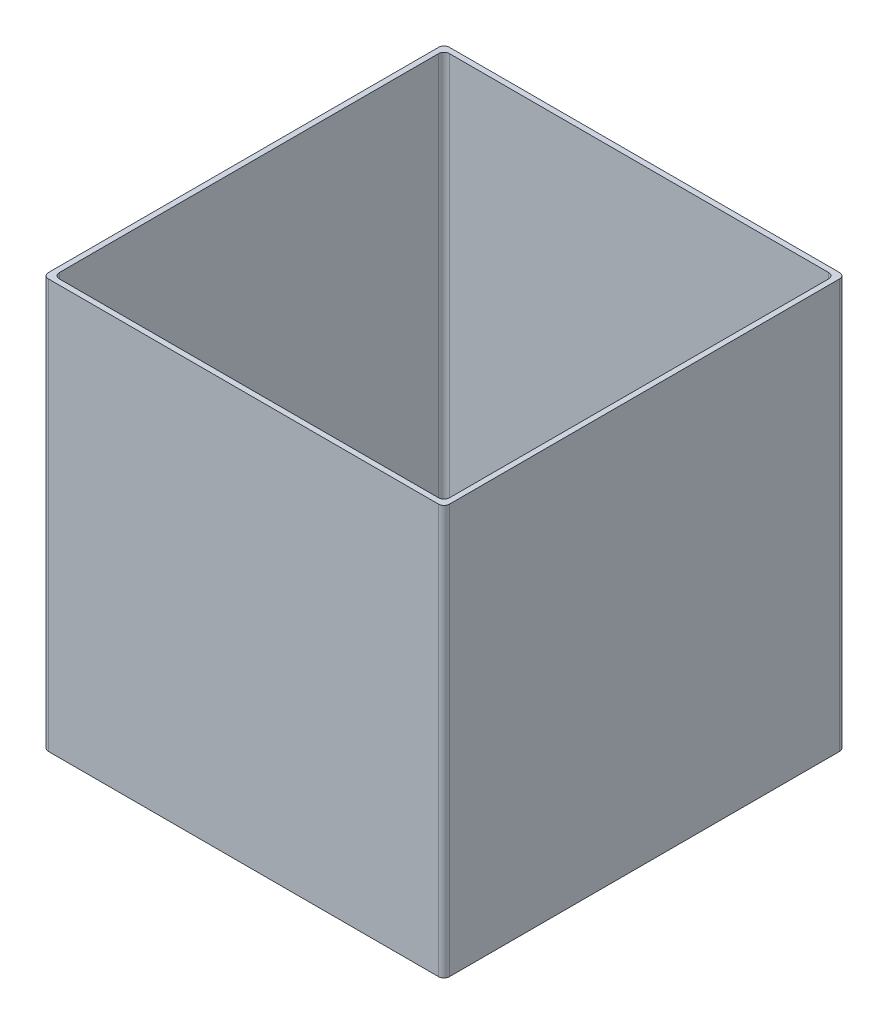
ISO-10303-21;
HEADER;
FILE_DESCRIPTION(('STEP AP214'),'2;1');
FILE_NAME('part.step','',(''),(''),'','','');
FILE_SCHEMA(('AUTOMOTIVE_DESIGN { 1 0 10303 214 1 1 1 1 }'));
ENDSEC;
DATA;
#1=APPLICATION_CONTEXT('core data for automotive mechanical design processes');
#2=APPLICATION_PROTOCOL_DEFINITION('international standard','automotive_design',2000,#1);
#3=PRODUCT_CONTEXT('',#1,'mechanical');
#4=PRODUCT('Part','Part','',(#3));
#5=PRODUCT_RELATED_PRODUCT_CATEGORY('part','',(#4));
#6=PRODUCT_DEFINITION_FORMATION('','',#4);
#7=PRODUCT_DEFINITION_CONTEXT('part definition',#1,'design');
#8=PRODUCT_DEFINITION('design','',#6,#7);
#9=PRODUCT_DEFINITION_SHAPE('','',#8);
#10=(LENGTH_UNIT() NAMED_UNIT(*) SI_UNIT(.MILLI.,.METRE.));
#11=(NAMED_UNIT(*) PLANE_ANGLE_UNIT() SI_UNIT($,.RADIAN.));
#12=(NAMED_UNIT(*) SI_UNIT($,.STERADIAN.) SOLID_ANGLE_UNIT());
#13=UNCERTAINTY_MEASURE_WITH_UNIT(LENGTH_MEASURE(1.E-05),#10,'distance_accuracy_value','');
#14=(GEOMETRIC_REPRESENTATION_CONTEXT(3) GLOBAL_UNCERTAINTY_ASSIGNED_CONTEXT((#13)) GLOBAL_UNIT_ASSIGNED_CONTEXT((#10,
#11,#12)) REPRESENTATION_CONTEXT('',''));
#15=CARTESIAN_POINT('',(0.,0.,0.));
#16=DIRECTION('',(0.,0.,1.));
#17=DIRECTION('',(1.,0.,0.));
#18=AXIS2_PLACEMENT_3D('',#15,#16,#17);
#19=CARTESIAN_POINT('',(2.,150.,-145.));
#20=DIRECTION('',(0.,-1.,0.));
#21=DIRECTION('',(0.,0.,-1.));
#22=AXIS2_PLACEMENT_3D('',#19,#20,#21);
#23=PLANE('',#22);
#24=CARTESIAN_POINT('',(2.,150.,-145.));
#25=DIRECTION('',(0.,1.,0.));
#26=DIRECTION('',(0.,0.,-1.));
#27=AXIS2_PLACEMENT_3D('',#24,#25,#26);
#28=CIRCLE('',#27,2.);
#29=CARTESIAN_POINT('',(2.00000000000001,150.,-147.));
#30=VERTEX_POINT('',#29);
#31=CARTESIAN_POINT('',(0.,150.,-145.));
#32=VERTEX_POINT('',#31);
#33=EDGE_CURVE('E215',#30,#32,#28,.T.);
#34=ORIENTED_EDGE('',*,*,#33,.T.);
#35=DIRECTION('',(0.,0.,1.));
#36=VECTOR('',#35,1.);
#37=CARTESIAN_POINT('',(0.,150.,-2.00000000000001));
#38=LINE('',#37,#36);
#39=CARTESIAN_POINT('',(0.,150.,-2.00000000000001));
#40=VERTEX_POINT('',#39);
#41=EDGE_CURVE('E218',#32,#40,#38,.T.);
#42=ORIENTED_EDGE('',*,*,#41,.T.);
#43=CARTESIAN_POINT('',(2.,150.,-2.));
#44=DIRECTION('',(0.,1.,0.));
#45=DIRECTION('',(0.,0.,-1.));
#46=AXIS2_PLACEMENT_3D('',#43,#44,#45);
#47=CIRCLE('',#46,2.);
#48=CARTESIAN_POINT('',(2.00000000000001,150.,0.));
#49=VERTEX_POINT('',#48);
#50=EDGE_CURVE('E221',#40,#49,#47,.T.);
#51=ORIENTED_EDGE('',*,*,#50,.T.);
#52=DIRECTION('',(1.,0.,0.));
#53=VECTOR('',#52,1.);
#54=CARTESIAN_POINT('',(2.00000000000001,150.,0.));
#55=LINE('',#54,#53);
#56=CARTESIAN_POINT('',(145.,150.,0.));
#57=VERTEX_POINT('',#56);
#58=EDGE_CURVE('E223',#49,#57,#55,.T.);
#59=ORIENTED_EDGE('',*,*,#58,.T.);
#60=CARTESIAN_POINT('',(145.,150.,-2.));
#61=DIRECTION('',(0.,1.,0.));
#62=DIRECTION('',(0.,0.,1.));
#63=AXIS2_PLACEMENT_3D('',#60,#61,#62);
#64=CIRCLE('',#63,2.);
#65=CARTESIAN_POINT('',(147.,150.,-2.00000000000001));
#66=VERTEX_POINT('',#65);
#67=EDGE_CURVE('E225',#57,#66,#64,.T.);
#68=ORIENTED_EDGE('',*,*,#67,.T.);
#69=DIRECTION('',(0.,0.,-1.));
#70=VECTOR('',#69,1.);
#71=CARTESIAN_POINT('',(147.,150.,-2.00000000000001));
#72=LINE('',#71,#70);
#73=CARTESIAN_POINT('',(147.,150.,-145.));
#74=VERTEX_POINT('',#73);
#75=EDGE_CURVE('E227',#66,#74,#72,.T.);
#76=ORIENTED_EDGE('',*,*,#75,.T.);
#77=CARTESIAN_POINT('',(145.,150.,-145.));
#78=DIRECTION('',(0.,1.,0.));
#79=DIRECTION('',(0.,0.,-1.));
#80=AXIS2_PLACEMENT_3D('',#77,#78,#79);
#81=CIRCLE('',#80,2.);
#82=CARTESIAN_POINT('',(145.,150.,-147.));
#83=VERTEX_POINT('',#82);
#84=EDGE_CURVE('E229',#74,#83,#81,.T.);
#85=ORIENTED_EDGE('',*,*,#84,.T.);
#86=DIRECTION('',(-1.,0.,0.));
#87=VECTOR('',#86,1.);
#88=CARTESIAN_POINT('',(2.00000000000001,150.,-147.));
#89=LINE('',#88,#87);
#90=EDGE_CURVE('E231',#83,#30,#89,.T.);
#91=ORIENTED_EDGE('',*,*,#90,.T.);
#92=EDGE_LOOP('',(#34,#42,#51,#59,#68,#76,#85,#91));
#93=FACE_BOUND('',#92,.T.);
#94=CARTESIAN_POINT('',(4.,150.,-143.));
#95=DIRECTION('',(0.,1.,0.));
#96=DIRECTION('',(0.,0.,1.));
#97=AXIS2_PLACEMENT_3D('',#94,#95,#96);
#98=CIRCLE('',#97,2.);
#99=CARTESIAN_POINT('',(4.00000000000001,150.,-145.));
#100=VERTEX_POINT('',#99);
#101=CARTESIAN_POINT('',(2.,150.,-143.));
#102=VERTEX_POINT('',#101);
#103=EDGE_CURVE('E150',#100,#102,#98,.T.);
#104=ORIENTED_EDGE('',*,*,#103,.F.);
#105=DIRECTION('',(-1.,0.,0.));
#106=VECTOR('',#105,1.);
#107=CARTESIAN_POINT('',(4.00000000000001,150.,-145.));
#108=LINE('',#107,#106);
#109=CARTESIAN_POINT('',(143.,150.,-145.));
#110=VERTEX_POINT('',#109);
#111=EDGE_CURVE('E183',#110,#100,#108,.T.);
#112=ORIENTED_EDGE('',*,*,#111,.F.);
#113=CARTESIAN_POINT('',(143.,150.,-143.));
#114=DIRECTION('',(0.,1.,0.));
#115=DIRECTION('',(0.,0.,-1.));
#116=AXIS2_PLACEMENT_3D('',#113,#114,#115);
#117=CIRCLE('',#116,2.);
#118=CARTESIAN_POINT('',(145.,150.,-143.));
#119=VERTEX_POINT('',#118);
#120=EDGE_CURVE('E181',#119,#110,#117,.T.);
#121=ORIENTED_EDGE('',*,*,#120,.F.);
#122=DIRECTION('',(0.,0.,-1.));
#123=VECTOR('',#122,1.);
#124=CARTESIAN_POINT('',(145.,150.,-143.));
#125=LINE('',#124,#123);
#126=CARTESIAN_POINT('',(145.,150.,-4.00000000000001));
#127=VERTEX_POINT('',#126);
#128=EDGE_CURVE('E179',#127,#119,#125,.T.);
#129=ORIENTED_EDGE('',*,*,#128,.F.);
#130=CARTESIAN_POINT('',(143.,150.,-4.));
#131=DIRECTION('',(0.,1.,0.));
#132=DIRECTION('',(0.,0.,1.));
#133=AXIS2_PLACEMENT_3D('',#130,#131,#132);
#134=CIRCLE('',#133,2.);
#135=CARTESIAN_POINT('',(143.,150.,-2.));
#136=VERTEX_POINT('',#135);
#137=EDGE_CURVE('E177',#136,#127,#134,.T.);
#138=ORIENTED_EDGE('',*,*,#137,.F.);
#139=DIRECTION('',(1.,0.,0.));
#140=VECTOR('',#139,1.);
#141=CARTESIAN_POINT('',(4.00000000000003,150.,-2.));
#142=LINE('',#141,#140);
#143=CARTESIAN_POINT('',(4.00000000000003,150.,-2.));
#144=VERTEX_POINT('',#143);
#145=EDGE_CURVE('E173',#144,#136,#142,.T.);
#146=ORIENTED_EDGE('',*,*,#145,.F.);
#147=CARTESIAN_POINT('',(4.00000000000002,150.,-4.));
#148=DIRECTION('',(0.,1.,0.));
#149=DIRECTION('',(0.,0.,1.));
#150=AXIS2_PLACEMENT_3D('',#147,#148,#149);
#151=CIRCLE('',#150,2.);
#152=CARTESIAN_POINT('',(2.00000000000002,150.,-4.00000000000002));
#153=VERTEX_POINT('',#152);
#154=EDGE_CURVE('E171',#153,#144,#151,.T.);
#155=ORIENTED_EDGE('',*,*,#154,.F.);
#156=DIRECTION('',(0.,0.,1.));
#157=VECTOR('',#156,1.);
#158=CARTESIAN_POINT('',(2.,150.,-143.));
#159=LINE('',#158,#157);
#160=EDGE_CURVE('E158',#102,#153,#159,.T.);
#161=ORIENTED_EDGE('',*,*,#160,.F.);
#162=EDGE_LOOP('',(#104,#112,#121,#129,#138,#146,#155,#161));
#163=FACE_BOUND('',#162,.T.);
#164=ADVANCED_FACE('F37',(#93,#163),#23,.F.);
#165=CARTESIAN_POINT('',(2.,0.,-145.));
#166=DIRECTION('',(0.,-1.,0.));
#167=DIRECTION('',(0.,0.,-1.));
#168=AXIS2_PLACEMENT_3D('',#165,#166,#167);
#169=PLANE('',#168);
#170=CARTESIAN_POINT('',(2.,0.,-145.));
#171=DIRECTION('',(0.,1.,0.));
#172=DIRECTION('',(0.,0.,-1.));
#173=AXIS2_PLACEMENT_3D('',#170,#171,#172);
#174=CIRCLE('',#173,2.);
#175=CARTESIAN_POINT('',(2.00000000000001,0.,-147.));
#176=VERTEX_POINT('',#175);
#177=CARTESIAN_POINT('',(0.,0.,-145.));
#178=VERTEX_POINT('',#177);
#179=EDGE_CURVE('E166',#176,#178,#174,.T.);
#180=ORIENTED_EDGE('',*,*,#179,.F.);
#181=DIRECTION('',(-1.,0.,0.));
#182=VECTOR('',#181,1.);
#183=CARTESIAN_POINT('',(2.00000000000001,0.,-147.));
#184=LINE('',#183,#182);
#185=CARTESIAN_POINT('',(145.,0.,-147.));
#186=VERTEX_POINT('',#185);
#187=EDGE_CURVE('E219',#186,#176,#184,.T.);
#188=ORIENTED_EDGE('',*,*,#187,.F.);
#189=CARTESIAN_POINT('',(145.,0.,-145.));
#190=DIRECTION('',(0.,1.,0.));
#191=DIRECTION('',(0.,0.,-1.));
#192=AXIS2_PLACEMENT_3D('',#189,#190,#191);
#193=CIRCLE('',#192,2.);
#194=CARTESIAN_POINT('',(147.,0.,-145.));
#195=VERTEX_POINT('',#194);
#196=EDGE_CURVE('E246',#195,#186,#193,.T.);
#197=ORIENTED_EDGE('',*,*,#196,.F.);
#198=DIRECTION('',(0.,0.,-1.));
#199=VECTOR('',#198,1.);
#200=CARTESIAN_POINT('',(147.,0.,-2.00000000000001));
#201=LINE('',#200,#199);
#202=CARTESIAN_POINT('',(147.,0.,-2.00000000000001));
#203=VERTEX_POINT('',#202);
#204=EDGE_CURVE('E244',#203,#195,#201,.T.);
#205=ORIENTED_EDGE('',*,*,#204,.F.);
#206=CARTESIAN_POINT('',(145.,0.,-2.));
#207=DIRECTION('',(0.,1.,0.));
#208=DIRECTION('',(0.,0.,1.));
#209=AXIS2_PLACEMENT_3D('',#206,#207,#208);
#210=CIRCLE('',#209,2.);
#211=CARTESIAN_POINT('',(145.,0.,0.));
#212=VERTEX_POINT('',#211);
#213=EDGE_CURVE('E242',#212,#203,#210,.T.);
#214=ORIENTED_EDGE('',*,*,#213,.F.);
#215=DIRECTION('',(1.,0.,0.));
#216=VECTOR('',#215,1.);
#217=CARTESIAN_POINT('',(2.00000000000001,0.,0.));
#218=LINE('',#217,#216);
#219=CARTESIAN_POINT('',(2.00000000000001,0.,0.));
#220=VERTEX_POINT('',#219);
#221=EDGE_CURVE('E240',#220,#212,#218,.T.);
#222=ORIENTED_EDGE('',*,*,#221,.F.);
#223=CARTESIAN_POINT('',(2.,0.,-2.));
#224=DIRECTION('',(0.,1.,0.));
#225=DIRECTION('',(0.,0.,-1.));
#226=AXIS2_PLACEMENT_3D('',#223,#224,#225);
#227=CIRCLE('',#226,2.);
#228=CARTESIAN_POINT('',(0.,0.,-2.00000000000001));
#229=VERTEX_POINT('',#228);
#230=EDGE_CURVE('E238',#229,#220,#227,.T.);
#231=ORIENTED_EDGE('',*,*,#230,.F.);
#232=DIRECTION('',(0.,0.,1.));
#233=VECTOR('',#232,1.);
#234=CARTESIAN_POINT('',(0.,0.,-2.00000000000001));
#235=LINE('',#234,#233);
#236=EDGE_CURVE('E236',#178,#229,#235,.T.);
#237=ORIENTED_EDGE('',*,*,#236,.F.);
#238=EDGE_LOOP('',(#180,#188,#197,#205,#214,#222,#231,#237));
#239=FACE_BOUND('',#238,.T.);
#240=DIRECTION('',(-1.,0.,0.));
#241=VECTOR('',#240,1.);
#242=CARTESIAN_POINT('',(4.00000000000001,0.,-145.));
#243=LINE('',#242,#241);
#244=CARTESIAN_POINT('',(143.,0.,-145.));
#245=VERTEX_POINT('',#244);
#246=CARTESIAN_POINT('',(4.00000000000001,0.,-145.));
#247=VERTEX_POINT('',#246);
#248=EDGE_CURVE('E159',#245,#247,#243,.T.);
#249=ORIENTED_EDGE('',*,*,#248,.T.);
#250=CARTESIAN_POINT('',(4.,0.,-143.));
#251=DIRECTION('',(0.,1.,0.));
#252=DIRECTION('',(0.,0.,1.));
#253=AXIS2_PLACEMENT_3D('',#250,#251,#252);
#254=CIRCLE('',#253,2.);
#255=CARTESIAN_POINT('',(2.,0.,-143.));
#256=VERTEX_POINT('',#255);
#257=EDGE_CURVE('E60',#247,#256,#254,.T.);
#258=ORIENTED_EDGE('',*,*,#257,.T.);
#259=DIRECTION('',(0.,0.,1.));
#260=VECTOR('',#259,1.);
#261=CARTESIAN_POINT('',(2.,0.,-143.));
#262=LINE('',#261,#260);
#263=CARTESIAN_POINT('',(2.00000000000002,0.,-4.00000000000002));
#264=VERTEX_POINT('',#263);
#265=EDGE_CURVE('E165',#256,#264,#262,.T.);
#266=ORIENTED_EDGE('',*,*,#265,.T.);
#267=CARTESIAN_POINT('',(4.00000000000002,0.,-4.));
#268=DIRECTION('',(0.,1.,0.));
#269=DIRECTION('',(0.,0.,1.));
#270=AXIS2_PLACEMENT_3D('',#267,#268,#269);
#271=CIRCLE('',#270,2.);
#272=CARTESIAN_POINT('',(4.00000000000003,0.,-2.));
#273=VERTEX_POINT('',#272);
#274=EDGE_CURVE('E187',#264,#273,#271,.T.);
#275=ORIENTED_EDGE('',*,*,#274,.T.);
#276=DIRECTION('',(1.,0.,0.));
#277=VECTOR('',#276,1.);
#278=CARTESIAN_POINT('',(4.00000000000003,0.,-2.));
#279=LINE('',#278,#277);
#280=CARTESIAN_POINT('',(143.,0.,-2.));
#281=VERTEX_POINT('',#280);
#282=EDGE_CURVE('E190',#273,#281,#279,.T.);
#283=ORIENTED_EDGE('',*,*,#282,.T.);
#284=CARTESIAN_POINT('',(143.,0.,-4.));
#285=DIRECTION('',(0.,1.,0.));
#286=DIRECTION('',(0.,0.,1.));
#287=AXIS2_PLACEMENT_3D('',#284,#285,#286);
#288=CIRCLE('',#287,2.);
#289=CARTESIAN_POINT('',(145.,0.,-4.00000000000001));
#290=VERTEX_POINT('',#289);
#291=EDGE_CURVE('E193',#281,#290,#288,.T.);
#292=ORIENTED_EDGE('',*,*,#291,.T.);
#293=DIRECTION('',(0.,0.,-1.));
#294=VECTOR('',#293,1.);
#295=CARTESIAN_POINT('',(145.,0.,-143.));
#296=LINE('',#295,#294);
#297=CARTESIAN_POINT('',(145.,0.,-143.));
#298=VERTEX_POINT('',#297);
#299=EDGE_CURVE('E196',#290,#298,#296,.T.);
#300=ORIENTED_EDGE('',*,*,#299,.T.);
#301=CARTESIAN_POINT('',(143.,0.,-143.));
#302=DIRECTION('',(0.,1.,0.));
#303=DIRECTION('',(0.,0.,-1.));
#304=AXIS2_PLACEMENT_3D('',#301,#302,#303);
#305=CIRCLE('',#304,2.);
#306=EDGE_CURVE('E199',#298,#245,#305,.T.);
#307=ORIENTED_EDGE('',*,*,#306,.T.);
#308=EDGE_LOOP('',(#249,#258,#266,#275,#283,#292,#300,#307));
#309=FACE_BOUND('',#308,.T.);
#310=ADVANCED_FACE('F276',(#239,#309),#169,.T.);
#311=CARTESIAN_POINT('',(2.,150.,-145.));
#312=DIRECTION('',(0.,-1.,0.));
#313=DIRECTION('',(0.,0.,-1.));
#314=AXIS2_PLACEMENT_3D('',#311,#312,#313);
#315=CYLINDRICAL_SURFACE('',#314,2.);
#316=ORIENTED_EDGE('',*,*,#179,.T.);
#317=DIRECTION('',(0.,-1.,0.));
#318=VECTOR('',#317,1.);
#319=CARTESIAN_POINT('',(0.,150.,-145.));
#320=LINE('',#319,#318);
#321=EDGE_CURVE('E11',#32,#178,#320,.T.);
#322=ORIENTED_EDGE('',*,*,#321,.F.);
#323=ORIENTED_EDGE('',*,*,#33,.F.);
#324=DIRECTION('',(0.,-1.,0.));
#325=VECTOR('',#324,1.);
#326=CARTESIAN_POINT('',(2.00000000000001,150.,-147.));
#327=LINE('',#326,#325);
#328=EDGE_CURVE('E233',#30,#176,#327,.T.);
#329=ORIENTED_EDGE('',*,*,#328,.T.);
#330=EDGE_LOOP('',(#316,#322,#323,#329));
#331=FACE_BOUND('',#330,.T.);
#332=ADVANCED_FACE('F39',(#331),#315,.T.);
#333=CARTESIAN_POINT('',(0.,150.,-2.00000000000001));
#334=DIRECTION('',(1.,0.,0.));
#335=DIRECTION('',(0.,0.,-1.));
#336=AXIS2_PLACEMENT_3D('',#333,#334,#335);
#337=PLANE('',#336);
#338=ORIENTED_EDGE('',*,*,#236,.T.);
#339=DIRECTION('',(0.,-1.,0.));
#340=VECTOR('',#339,1.);
#341=CARTESIAN_POINT('',(0.,150.,-2.00000000000001));
#342=LINE('',#341,#340);
#343=EDGE_CURVE('E45',#40,#229,#342,.T.);
#344=ORIENTED_EDGE('',*,*,#343,.F.);
#345=ORIENTED_EDGE('',*,*,#41,.F.);
#346=ORIENTED_EDGE('',*,*,#321,.T.);
#347=EDGE_LOOP('',(#338,#344,#345,#346));
#348=FACE_BOUND('',#347,.T.);
#349=ADVANCED_FACE('F293',(#348),#337,.F.);
#350=CARTESIAN_POINT('',(2.,150.,-2.));
#351=DIRECTION('',(0.,-1.,0.));
#352=DIRECTION('',(0.,0.,-1.));
#353=AXIS2_PLACEMENT_3D('',#350,#351,#352);
#354=CYLINDRICAL_SURFACE('',#353,2.);
#355=ORIENTED_EDGE('',*,*,#230,.T.);
#356=DIRECTION('',(0.,-1.,0.));
#357=VECTOR('',#356,1.);
#358=CARTESIAN_POINT('',(2.00000000000001,150.,0.));
#359=LINE('',#358,#357);
#360=EDGE_CURVE('E263',#49,#220,#359,.T.);
#361=ORIENTED_EDGE('',*,*,#360,.F.);
#362=ORIENTED_EDGE('',*,*,#50,.F.);
#363=ORIENTED_EDGE('',*,*,#343,.T.);
#364=EDGE_LOOP('',(#355,#361,#362,#363));
#365=FACE_BOUND('',#364,.T.);
#366=ADVANCED_FACE('F270',(#365),#354,.T.);
#367=CARTESIAN_POINT('',(2.00000000000001,150.,0.));
#368=DIRECTION('',(0.,0.,-1.));
#369=DIRECTION('',(-1.,0.,0.));
#370=AXIS2_PLACEMENT_3D('',#367,#368,#369);
#371=PLANE('',#370);
#372=ORIENTED_EDGE('',*,*,#221,.T.);
#373=DIRECTION('',(0.,-1.,0.));
#374=VECTOR('',#373,1.);
#375=CARTESIAN_POINT('',(145.,150.,0.));
#376=LINE('',#375,#374);
#377=EDGE_CURVE('E260',#57,#212,#376,.T.);
#378=ORIENTED_EDGE('',*,*,#377,.F.);
#379=ORIENTED_EDGE('',*,*,#58,.F.);
#380=ORIENTED_EDGE('',*,*,#360,.T.);
#381=EDGE_LOOP('',(#372,#378,#379,#380));
#382=FACE_BOUND('',#381,.T.);
#383=ADVANCED_FACE('F282',(#382),#371,.F.);
#384=CARTESIAN_POINT('',(145.,150.,-2.));
#385=DIRECTION('',(0.,-1.,0.));
#386=DIRECTION('',(0.,0.,-1.));
#387=AXIS2_PLACEMENT_3D('',#384,#385,#386);
#388=CYLINDRICAL_SURFACE('',#387,2.);
#389=ORIENTED_EDGE('',*,*,#213,.T.);
#390=DIRECTION('',(0.,-1.,0.));
#391=VECTOR('',#390,1.);
#392=CARTESIAN_POINT('',(147.,150.,-2.00000000000001));
#393=LINE('',#392,#391);
#394=EDGE_CURVE('E257',#66,#203,#393,.T.);
#395=ORIENTED_EDGE('',*,*,#394,.F.);
#396=ORIENTED_EDGE('',*,*,#67,.F.);
#397=ORIENTED_EDGE('',*,*,#377,.T.);
#398=EDGE_LOOP('',(#389,#395,#396,#397));
#399=FACE_BOUND('',#398,.T.);
#400=ADVANCED_FACE('F286',(#399),#388,.T.);
#401=CARTESIAN_POINT('',(147.,150.,-2.00000000000001));
#402=DIRECTION('',(-1.,0.,0.));
#403=DIRECTION('',(0.,0.,1.));
#404=AXIS2_PLACEMENT_3D('',#401,#402,#403);
#405=PLANE('',#404);
#406=ORIENTED_EDGE('',*,*,#204,.T.);
#407=DIRECTION('',(0.,-1.,0.));
#408=VECTOR('',#407,1.);
#409=CARTESIAN_POINT('',(147.,150.,-145.));
#410=LINE('',#409,#408);
#411=EDGE_CURVE('E254',#74,#195,#410,.T.);
#412=ORIENTED_EDGE('',*,*,#411,.F.);
#413=ORIENTED_EDGE('',*,*,#75,.F.);
#414=ORIENTED_EDGE('',*,*,#394,.T.);
#415=EDGE_LOOP('',(#406,#412,#413,#414));
#416=FACE_BOUND('',#415,.T.);
#417=ADVANCED_FACE('F306',(#416),#405,.F.);
#418=CARTESIAN_POINT('',(145.,150.,-145.));
#419=DIRECTION('',(0.,-1.,0.));
#420=DIRECTION('',(0.,0.,-1.));
#421=AXIS2_PLACEMENT_3D('',#418,#419,#420);
#422=CYLINDRICAL_SURFACE('',#421,2.);
#423=ORIENTED_EDGE('',*,*,#196,.T.);
#424=DIRECTION('',(0.,-1.,0.));
#425=VECTOR('',#424,1.);
#426=CARTESIAN_POINT('',(145.,150.,-147.));
#427=LINE('',#426,#425);
#428=EDGE_CURVE('E251',#83,#186,#427,.T.);
#429=ORIENTED_EDGE('',*,*,#428,.F.);
#430=ORIENTED_EDGE('',*,*,#84,.F.);
#431=ORIENTED_EDGE('',*,*,#411,.T.);
#432=EDGE_LOOP('',(#423,#429,#430,#431));
#433=FACE_BOUND('',#432,.T.);
#434=ADVANCED_FACE('F304',(#433),#422,.T.);
#435=CARTESIAN_POINT('',(2.00000000000001,150.,-147.));
#436=DIRECTION('',(0.,0.,1.));
#437=DIRECTION('',(1.,0.,0.));
#438=AXIS2_PLACEMENT_3D('',#435,#436,#437);
#439=PLANE('',#438);
#440=ORIENTED_EDGE('',*,*,#187,.T.);
#441=ORIENTED_EDGE('',*,*,#328,.F.);
#442=ORIENTED_EDGE('',*,*,#90,.F.);
#443=ORIENTED_EDGE('',*,*,#428,.T.);
#444=EDGE_LOOP('',(#440,#441,#442,#443));
#445=FACE_BOUND('',#444,.T.);
#446=ADVANCED_FACE('F299',(#445),#439,.F.);
#447=CARTESIAN_POINT('',(4.,150.,-143.));
#448=DIRECTION('',(0.,-1.,0.));
#449=DIRECTION('',(0.,0.,-1.));
#450=AXIS2_PLACEMENT_3D('',#447,#448,#449);
#451=CYLINDRICAL_SURFACE('',#450,2.);
#452=ORIENTED_EDGE('',*,*,#257,.F.);
#453=DIRECTION('',(0.,-1.,0.));
#454=VECTOR('',#453,1.);
#455=CARTESIAN_POINT('',(4.00000000000001,150.,-145.));
#456=LINE('',#455,#454);
#457=EDGE_CURVE('E154',#100,#247,#456,.T.);
#458=ORIENTED_EDGE('',*,*,#457,.F.);
#459=ORIENTED_EDGE('',*,*,#103,.T.);
#460=DIRECTION('',(0.,-1.,0.));
#461=VECTOR('',#460,1.);
#462=CARTESIAN_POINT('',(2.,150.,-143.));
#463=LINE('',#462,#461);
#464=EDGE_CURVE('E153',#102,#256,#463,.T.);
#465=ORIENTED_EDGE('',*,*,#464,.T.);
#466=EDGE_LOOP('',(#452,#458,#459,#465));
#467=FACE_BOUND('',#466,.T.);
#468=ADVANCED_FACE('F152',(#467),#451,.F.);
#469=CARTESIAN_POINT('',(2.,150.,-143.));
#470=DIRECTION('',(1.,0.,0.));
#471=DIRECTION('',(0.,0.,-1.));
#472=AXIS2_PLACEMENT_3D('',#469,#470,#471);
#473=PLANE('',#472);
#474=ORIENTED_EDGE('',*,*,#265,.F.);
#475=ORIENTED_EDGE('',*,*,#464,.F.);
#476=ORIENTED_EDGE('',*,*,#160,.T.);
#477=DIRECTION('',(0.,-1.,0.));
#478=VECTOR('',#477,1.);
#479=CARTESIAN_POINT('',(2.00000000000002,150.,-4.00000000000002));
#480=LINE('',#479,#478);
#481=EDGE_CURVE('E167',#153,#264,#480,.T.);
#482=ORIENTED_EDGE('',*,*,#481,.T.);
#483=EDGE_LOOP('',(#474,#475,#476,#482));
#484=FACE_BOUND('',#483,.T.);
#485=ADVANCED_FACE('F162',(#484),#473,.T.);
#486=CARTESIAN_POINT('',(4.00000000000002,150.,-4.));
#487=DIRECTION('',(0.,-1.,0.));
#488=DIRECTION('',(0.,0.,-1.));
#489=AXIS2_PLACEMENT_3D('',#486,#487,#488);
#490=CYLINDRICAL_SURFACE('',#489,2.);
#491=ORIENTED_EDGE('',*,*,#274,.F.);
#492=ORIENTED_EDGE('',*,*,#481,.F.);
#493=ORIENTED_EDGE('',*,*,#154,.T.);
#494=DIRECTION('',(0.,-1.,0.));
#495=VECTOR('',#494,1.);
#496=CARTESIAN_POINT('',(4.00000000000003,150.,-2.));
#497=LINE('',#496,#495);
#498=EDGE_CURVE('E212',#144,#273,#497,.T.);
#499=ORIENTED_EDGE('',*,*,#498,.T.);
#500=EDGE_LOOP('',(#491,#492,#493,#499));
#501=FACE_BOUND('',#500,.T.);
#502=ADVANCED_FACE('F331',(#501),#490,.F.);
#503=CARTESIAN_POINT('',(4.00000000000003,150.,-2.));
#504=DIRECTION('',(0.,0.,-1.));
#505=DIRECTION('',(-1.,0.,0.));
#506=AXIS2_PLACEMENT_3D('',#503,#504,#505);
#507=PLANE('',#506);
#508=ORIENTED_EDGE('',*,*,#282,.F.);
#509=ORIENTED_EDGE('',*,*,#498,.F.);
#510=ORIENTED_EDGE('',*,*,#145,.T.);
#511=DIRECTION('',(0.,-1.,0.));
#512=VECTOR('',#511,1.);
#513=CARTESIAN_POINT('',(143.,150.,-2.));
#514=LINE('',#513,#512);
#515=EDGE_CURVE('E210',#136,#281,#514,.T.);
#516=ORIENTED_EDGE('',*,*,#515,.T.);
#517=EDGE_LOOP('',(#508,#509,#510,#516));
#518=FACE_BOUND('',#517,.T.);
#519=ADVANCED_FACE('F335',(#518),#507,.T.);
#520=CARTESIAN_POINT('',(143.,150.,-4.));
#521=DIRECTION('',(0.,-1.,0.));
#522=DIRECTION('',(0.,0.,-1.));
#523=AXIS2_PLACEMENT_3D('',#520,#521,#522);
#524=CYLINDRICAL_SURFACE('',#523,2.);
#525=ORIENTED_EDGE('',*,*,#291,.F.);
#526=ORIENTED_EDGE('',*,*,#515,.F.);
#527=ORIENTED_EDGE('',*,*,#137,.T.);
#528=DIRECTION('',(0.,-1.,0.));
#529=VECTOR('',#528,1.);
#530=CARTESIAN_POINT('',(145.,150.,-4.00000000000001));
#531=LINE('',#530,#529);
#532=EDGE_CURVE('E208',#127,#290,#531,.T.);
#533=ORIENTED_EDGE('',*,*,#532,.T.);
#534=EDGE_LOOP('',(#525,#526,#527,#533));
#535=FACE_BOUND('',#534,.T.);
#536=ADVANCED_FACE('F341',(#535),#524,.F.);
#537=CARTESIAN_POINT('',(145.,150.,-143.));
#538=DIRECTION('',(-1.,0.,0.));
#539=DIRECTION('',(0.,0.,1.));
#540=AXIS2_PLACEMENT_3D('',#537,#538,#539);
#541=PLANE('',#540);
#542=ORIENTED_EDGE('',*,*,#299,.F.);
#543=ORIENTED_EDGE('',*,*,#532,.F.);
#544=ORIENTED_EDGE('',*,*,#128,.T.);
#545=DIRECTION('',(0.,-1.,0.));
#546=VECTOR('',#545,1.);
#547=CARTESIAN_POINT('',(145.,150.,-143.));
#548=LINE('',#547,#546);
#549=EDGE_CURVE('E206',#119,#298,#548,.T.);
#550=ORIENTED_EDGE('',*,*,#549,.T.);
#551=EDGE_LOOP('',(#542,#543,#544,#550));
#552=FACE_BOUND('',#551,.T.);
#553=ADVANCED_FACE('F345',(#552),#541,.T.);
#554=CARTESIAN_POINT('',(143.,150.,-143.));
#555=DIRECTION('',(0.,-1.,0.));
#556=DIRECTION('',(0.,0.,-1.));
#557=AXIS2_PLACEMENT_3D('',#554,#555,#556);
#558=CYLINDRICAL_SURFACE('',#557,2.);
#559=ORIENTED_EDGE('',*,*,#306,.F.);
#560=ORIENTED_EDGE('',*,*,#549,.F.);
#561=ORIENTED_EDGE('',*,*,#120,.T.);
#562=DIRECTION('',(0.,-1.,0.));
#563=VECTOR('',#562,1.);
#564=CARTESIAN_POINT('',(143.,150.,-145.));
#565=LINE('',#564,#563);
#566=EDGE_CURVE('E52',#110,#245,#565,.T.);
#567=ORIENTED_EDGE('',*,*,#566,.T.);
#568=EDGE_LOOP('',(#559,#560,#561,#567));
#569=FACE_BOUND('',#568,.T.);
#570=ADVANCED_FACE('F349',(#569),#558,.F.);
#571=CARTESIAN_POINT('',(4.00000000000001,150.,-145.));
#572=DIRECTION('',(0.,0.,1.));
#573=DIRECTION('',(1.,0.,0.));
#574=AXIS2_PLACEMENT_3D('',#571,#572,#573);
#575=PLANE('',#574);
#576=ORIENTED_EDGE('',*,*,#248,.F.);
#577=ORIENTED_EDGE('',*,*,#566,.F.);
#578=ORIENTED_EDGE('',*,*,#111,.T.);
#579=ORIENTED_EDGE('',*,*,#457,.T.);
#580=EDGE_LOOP('',(#576,#577,#578,#579));
#581=FACE_BOUND('',#580,.T.);
#582=ADVANCED_FACE('F353',(#581),#575,.T.);
#583=CLOSED_SHELL('',(#164,#310,#332,#349,#366,#383,#400,#417,#434,#446,#468,#485,#502,#519,
#536,#553,#570,#582));
#584=MANIFOLD_SOLID_BREP('B2',#583);
#585=ADVANCED_BREP_SHAPE_REPRESENTATION('',(#18,#584),#14);
#586=SHAPE_DEFINITION_REPRESENTATION(#9,#585);
ENDSEC;
END-ISO-10303-21;
